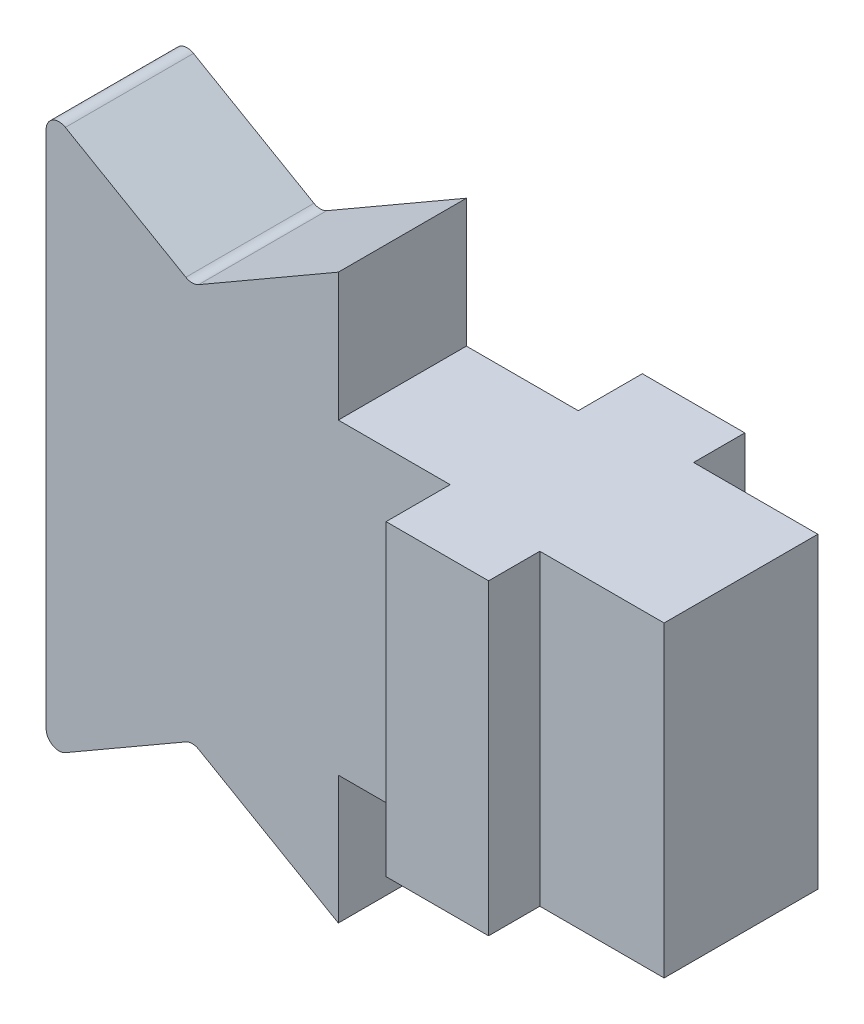
ISO-10303-21;
HEADER;
FILE_DESCRIPTION(('STEP AP214'),'2;1');
FILE_NAME('part.step','',(''),(''),'','','');
FILE_SCHEMA(('AUTOMOTIVE_DESIGN { 1 0 10303 214 1 1 1 1 }'));
ENDSEC;
DATA;
#1=APPLICATION_CONTEXT('core data for automotive mechanical design processes');
#2=APPLICATION_PROTOCOL_DEFINITION('international standard','automotive_design',2000,#1);
#3=PRODUCT_CONTEXT('',#1,'mechanical');
#4=PRODUCT('Part','Part','',(#3));
#5=PRODUCT_RELATED_PRODUCT_CATEGORY('part','',(#4));
#6=PRODUCT_DEFINITION_FORMATION('','',#4);
#7=PRODUCT_DEFINITION_CONTEXT('part definition',#1,'design');
#8=PRODUCT_DEFINITION('design','',#6,#7);
#9=PRODUCT_DEFINITION_SHAPE('','',#8);
#10=(LENGTH_UNIT() NAMED_UNIT(*) SI_UNIT(.MILLI.,.METRE.));
#11=(NAMED_UNIT(*) PLANE_ANGLE_UNIT() SI_UNIT($,.RADIAN.));
#12=(NAMED_UNIT(*) SI_UNIT($,.STERADIAN.) SOLID_ANGLE_UNIT());
#13=UNCERTAINTY_MEASURE_WITH_UNIT(LENGTH_MEASURE(1.E-05),#10,'distance_accuracy_value','');
#14=(GEOMETRIC_REPRESENTATION_CONTEXT(3) GLOBAL_UNCERTAINTY_ASSIGNED_CONTEXT((#13)) GLOBAL_UNIT_ASSIGNED_CONTEXT((#10,
#11,#12)) REPRESENTATION_CONTEXT('',''));
#15=CARTESIAN_POINT('',(0.,0.,0.));
#16=DIRECTION('',(0.,0.,1.));
#17=DIRECTION('',(1.,0.,0.));
#18=AXIS2_PLACEMENT_3D('',#15,#16,#17);
#19=CARTESIAN_POINT('',(-28.1320066515452,-16.5717489288077,5.));
#20=DIRECTION('',(0.,0.,-1.));
#21=DIRECTION('',(-1.,0.,0.));
#22=AXIS2_PLACEMENT_3D('',#19,#20,#21);
#23=CYLINDRICAL_SURFACE('',#22,1.);
#24=DIRECTION('',(0.,0.,1.));
#25=VECTOR('',#24,1.);
#26=CARTESIAN_POINT('',(-28.6320066515452,-15.7057235250233,5.));
#27=LINE('',#26,#25);
#28=CARTESIAN_POINT('',(-28.6320066515452,-15.7057235250233,5.));
#29=VERTEX_POINT('',#28);
#30=CARTESIAN_POINT('',(-28.6320066515452,-15.7057235250233,-5.));
#31=VERTEX_POINT('',#30);
#32=EDGE_CURVE('E255',#29,#31,#27,.F.);
#33=ORIENTED_EDGE('',*,*,#32,.T.);
#34=CARTESIAN_POINT('',(-28.1320066515452,-16.5717489288077,-5.));
#35=DIRECTION('',(0.,0.,-1.));
#36=DIRECTION('',(-1.,0.,0.));
#37=AXIS2_PLACEMENT_3D('',#34,#35,#36);
#38=CIRCLE('',#37,1.);
#39=CARTESIAN_POINT('',(-27.6320066515452,-15.7057235250233,-5.));
#40=VERTEX_POINT('',#39);
#41=EDGE_CURVE('E201',#31,#40,#38,.T.);
#42=ORIENTED_EDGE('',*,*,#41,.T.);
#43=DIRECTION('',(0.,0.,1.));
#44=VECTOR('',#43,1.);
#45=CARTESIAN_POINT('',(-27.6320066515452,-15.7057235250233,5.));
#46=LINE('',#45,#44);
#47=CARTESIAN_POINT('',(-27.6320066515452,-15.7057235250233,5.));
#48=VERTEX_POINT('',#47);
#49=EDGE_CURVE('E213',#40,#48,#46,.T.);
#50=ORIENTED_EDGE('',*,*,#49,.T.);
#51=CARTESIAN_POINT('',(-28.1320066515452,-16.5717489288077,5.));
#52=DIRECTION('',(0.,0.,-1.));
#53=DIRECTION('',(-1.,0.,0.));
#54=AXIS2_PLACEMENT_3D('',#51,#52,#53);
#55=CIRCLE('',#54,1.);
#56=EDGE_CURVE('E20',#29,#48,#55,.T.);
#57=ORIENTED_EDGE('',*,*,#56,.F.);
#58=EDGE_LOOP('',(#33,#42,#50,#57));
#59=FACE_BOUND('',#58,.T.);
#60=ADVANCED_FACE('F17',(#59),#23,.F.);
#61=CARTESIAN_POINT('',(-8.,12.,10.));
#62=DIRECTION('',(1.,0.,0.));
#63=DIRECTION('',(0.,1.,0.));
#64=AXIS2_PLACEMENT_3D('',#61,#62,#63);
#65=PLANE('',#64);
#66=DIRECTION('',(0.,1.,0.));
#67=VECTOR('',#66,1.);
#68=CARTESIAN_POINT('',(-8.,-2.,-5.));
#69=LINE('',#68,#67);
#70=CARTESIAN_POINT('',(-8.,-12.,-5.));
#71=VERTEX_POINT('',#70);
#72=CARTESIAN_POINT('',(-8.,12.,-5.));
#73=VERTEX_POINT('',#72);
#74=EDGE_CURVE('E165',#71,#73,#69,.T.);
#75=ORIENTED_EDGE('',*,*,#74,.T.);
#76=DIRECTION('',(0.,0.,1.));
#77=VECTOR('',#76,1.);
#78=CARTESIAN_POINT('',(-8.,12.,5.));
#79=LINE('',#78,#77);
#80=CARTESIAN_POINT('',(-8.,12.,-10.));
#81=VERTEX_POINT('',#80);
#82=EDGE_CURVE('E159',#73,#81,#79,.F.);
#83=ORIENTED_EDGE('',*,*,#82,.T.);
#84=DIRECTION('',(0.,1.,0.));
#85=VECTOR('',#84,1.);
#86=CARTESIAN_POINT('',(-8.,-12.,-10.));
#87=LINE('',#86,#85);
#88=CARTESIAN_POINT('',(-8.,-12.,-10.));
#89=VERTEX_POINT('',#88);
#90=EDGE_CURVE('E162',#81,#89,#87,.F.);
#91=ORIENTED_EDGE('',*,*,#90,.T.);
#92=DIRECTION('',(0.,0.,1.));
#93=VECTOR('',#92,1.);
#94=CARTESIAN_POINT('',(-8.,-12.,5.));
#95=LINE('',#94,#93);
#96=EDGE_CURVE('E219',#89,#71,#95,.T.);
#97=ORIENTED_EDGE('',*,*,#96,.T.);
#98=EDGE_LOOP('',(#75,#83,#91,#97));
#99=FACE_BOUND('',#98,.T.);
#100=ADVANCED_FACE('F161',(#99),#65,.F.);
#101=CARTESIAN_POINT('',(-8.,-12.,-10.));
#102=DIRECTION('',(0.,0.,1.));
#103=DIRECTION('',(1.,0.,0.));
#104=AXIS2_PLACEMENT_3D('',#101,#102,#103);
#105=PLANE('',#104);
#106=DIRECTION('',(1.,0.,0.));
#107=VECTOR('',#106,1.);
#108=CARTESIAN_POINT('',(-16.5,12.,-10.));
#109=LINE('',#108,#107);
#110=CARTESIAN_POINT('',(0.,12.,-10.));
#111=VERTEX_POINT('',#110);
#112=EDGE_CURVE('E170',#81,#111,#109,.T.);
#113=ORIENTED_EDGE('',*,*,#112,.T.);
#114=DIRECTION('',(0.,-1.,0.));
#115=VECTOR('',#114,1.);
#116=CARTESIAN_POINT('',(0.,12.,-10.));
#117=LINE('',#116,#115);
#118=CARTESIAN_POINT('',(0.,-12.,-10.));
#119=VERTEX_POINT('',#118);
#120=EDGE_CURVE('E179',#111,#119,#117,.T.);
#121=ORIENTED_EDGE('',*,*,#120,.T.);
#122=DIRECTION('',(-1.,0.,0.));
#123=VECTOR('',#122,1.);
#124=CARTESIAN_POINT('',(0.,-12.,-10.));
#125=LINE('',#124,#123);
#126=EDGE_CURVE('E177',#119,#89,#125,.T.);
#127=ORIENTED_EDGE('',*,*,#126,.T.);
#128=ORIENTED_EDGE('',*,*,#90,.F.);
#129=EDGE_LOOP('',(#113,#121,#127,#128));
#130=FACE_BOUND('',#129,.T.);
#131=ADVANCED_FACE('F174',(#130),#105,.F.);
#132=CARTESIAN_POINT('',(0.,12.,5.));
#133=DIRECTION('',(-1.,0.,0.));
#134=DIRECTION('',(0.,-1.,0.));
#135=AXIS2_PLACEMENT_3D('',#132,#133,#134);
#136=PLANE('',#135);
#137=DIRECTION('',(0.,0.,1.));
#138=VECTOR('',#137,1.);
#139=CARTESIAN_POINT('',(0.,-12.,5.));
#140=LINE('',#139,#138);
#141=CARTESIAN_POINT('',(0.,-12.,-6.));
#142=VERTEX_POINT('',#141);
#143=EDGE_CURVE('E226',#142,#119,#140,.F.);
#144=ORIENTED_EDGE('',*,*,#143,.T.);
#145=ORIENTED_EDGE('',*,*,#120,.F.);
#146=DIRECTION('',(0.,0.,1.));
#147=VECTOR('',#146,1.);
#148=CARTESIAN_POINT('',(0.,12.,5.));
#149=LINE('',#148,#147);
#150=CARTESIAN_POINT('',(0.,12.,-6.));
#151=VERTEX_POINT('',#150);
#152=EDGE_CURVE('E185',#111,#151,#149,.T.);
#153=ORIENTED_EDGE('',*,*,#152,.T.);
#154=DIRECTION('',(0.,1.,0.));
#155=VECTOR('',#154,1.);
#156=CARTESIAN_POINT('',(0.,-27.4301652615907,-6.));
#157=LINE('',#156,#155);
#158=EDGE_CURVE('E318',#142,#151,#157,.T.);
#159=ORIENTED_EDGE('',*,*,#158,.F.);
#160=EDGE_LOOP('',(#144,#145,#153,#159));
#161=FACE_BOUND('',#160,.T.);
#162=ADVANCED_FACE('F331',(#161),#136,.F.);
#163=CARTESIAN_POINT('',(0.,-27.4301652615907,-6.));
#164=DIRECTION('',(0.,0.,-1.));
#165=DIRECTION('',(-1.,0.,0.));
#166=AXIS2_PLACEMENT_3D('',#163,#164,#165);
#167=PLANE('',#166);
#168=DIRECTION('',(1.,0.,0.));
#169=VECTOR('',#168,1.);
#170=CARTESIAN_POINT('',(-16.5,12.,-6.));
#171=LINE('',#170,#169);
#172=CARTESIAN_POINT('',(9.7,12.,-6.));
#173=VERTEX_POINT('',#172);
#174=EDGE_CURVE('E187',#151,#173,#171,.T.);
#175=ORIENTED_EDGE('',*,*,#174,.T.);
#176=DIRECTION('',(0.,1.,0.));
#177=VECTOR('',#176,1.);
#178=CARTESIAN_POINT('',(9.7,-27.4301652615907,-6.));
#179=LINE('',#178,#177);
#180=CARTESIAN_POINT('',(9.7,-12.,-6.));
#181=VERTEX_POINT('',#180);
#182=EDGE_CURVE('E310',#181,#173,#179,.T.);
#183=ORIENTED_EDGE('',*,*,#182,.F.);
#184=DIRECTION('',(-1.,0.,0.));
#185=VECTOR('',#184,1.);
#186=CARTESIAN_POINT('',(0.,-12.,-6.));
#187=LINE('',#186,#185);
#188=EDGE_CURVE('E231',#181,#142,#187,.T.);
#189=ORIENTED_EDGE('',*,*,#188,.T.);
#190=ORIENTED_EDGE('',*,*,#158,.T.);
#191=EDGE_LOOP('',(#175,#183,#189,#190));
#192=FACE_BOUND('',#191,.T.);
#193=ADVANCED_FACE('F629',(#192),#167,.T.);
#194=CARTESIAN_POINT('',(9.7,-27.4301652615907,6.));
#195=DIRECTION('',(1.,0.,0.));
#196=DIRECTION('',(0.,0.,-1.));
#197=AXIS2_PLACEMENT_3D('',#194,#195,#196);
#198=PLANE('',#197);
#199=DIRECTION('',(0.,0.,1.));
#200=VECTOR('',#199,1.);
#201=CARTESIAN_POINT('',(9.7,12.,5.));
#202=LINE('',#201,#200);
#203=CARTESIAN_POINT('',(9.7,12.,6.));
#204=VERTEX_POINT('',#203);
#205=EDGE_CURVE('E305',#173,#204,#202,.T.);
#206=ORIENTED_EDGE('',*,*,#205,.T.);
#207=DIRECTION('',(0.,1.,0.));
#208=VECTOR('',#207,1.);
#209=CARTESIAN_POINT('',(9.7,-27.4301652615907,6.));
#210=LINE('',#209,#208);
#211=CARTESIAN_POINT('',(9.7,-12.,6.));
#212=VERTEX_POINT('',#211);
#213=EDGE_CURVE('E288',#212,#204,#210,.T.);
#214=ORIENTED_EDGE('',*,*,#213,.F.);
#215=DIRECTION('',(0.,0.,1.));
#216=VECTOR('',#215,1.);
#217=CARTESIAN_POINT('',(9.7,-12.,5.));
#218=LINE('',#217,#216);
#219=EDGE_CURVE('E236',#212,#181,#218,.F.);
#220=ORIENTED_EDGE('',*,*,#219,.T.);
#221=ORIENTED_EDGE('',*,*,#182,.T.);
#222=EDGE_LOOP('',(#206,#214,#220,#221));
#223=FACE_BOUND('',#222,.T.);
#224=ADVANCED_FACE('F619',(#223),#198,.T.);
#225=CARTESIAN_POINT('',(0.,-27.4301652615907,6.));
#226=DIRECTION('',(0.,0.,1.));
#227=DIRECTION('',(1.,0.,0.));
#228=AXIS2_PLACEMENT_3D('',#225,#226,#227);
#229=PLANE('',#228);
#230=DIRECTION('',(1.,0.,0.));
#231=VECTOR('',#230,1.);
#232=CARTESIAN_POINT('',(-16.5,12.,6.));
#233=LINE('',#232,#231);
#234=CARTESIAN_POINT('',(0.,12.,6.));
#235=VERTEX_POINT('',#234);
#236=EDGE_CURVE('E299',#204,#235,#233,.F.);
#237=ORIENTED_EDGE('',*,*,#236,.T.);
#238=DIRECTION('',(0.,-1.,0.));
#239=VECTOR('',#238,1.);
#240=CARTESIAN_POINT('',(0.,12.,6.));
#241=LINE('',#240,#239);
#242=CARTESIAN_POINT('',(0.,-12.,6.));
#243=VERTEX_POINT('',#242);
#244=EDGE_CURVE('E283',#235,#243,#241,.T.);
#245=ORIENTED_EDGE('',*,*,#244,.T.);
#246=DIRECTION('',(-1.,0.,0.));
#247=VECTOR('',#246,1.);
#248=CARTESIAN_POINT('',(0.,-12.,6.));
#249=LINE('',#248,#247);
#250=EDGE_CURVE('E241',#243,#212,#249,.F.);
#251=ORIENTED_EDGE('',*,*,#250,.T.);
#252=ORIENTED_EDGE('',*,*,#213,.T.);
#253=EDGE_LOOP('',(#237,#245,#251,#252));
#254=FACE_BOUND('',#253,.T.);
#255=ADVANCED_FACE('F609',(#254),#229,.T.);
#256=CARTESIAN_POINT('',(0.,12.,5.));
#257=DIRECTION('',(-1.,0.,0.));
#258=DIRECTION('',(0.,-1.,0.));
#259=AXIS2_PLACEMENT_3D('',#256,#257,#258);
#260=PLANE('',#259);
#261=ORIENTED_EDGE('',*,*,#244,.F.);
#262=DIRECTION('',(0.,0.,1.));
#263=VECTOR('',#262,1.);
#264=CARTESIAN_POINT('',(0.,12.,5.));
#265=LINE('',#264,#263);
#266=CARTESIAN_POINT('',(0.,12.,10.));
#267=VERTEX_POINT('',#266);
#268=EDGE_CURVE('E296',#235,#267,#265,.T.);
#269=ORIENTED_EDGE('',*,*,#268,.T.);
#270=DIRECTION('',(0.,1.,0.));
#271=VECTOR('',#270,1.);
#272=CARTESIAN_POINT('',(0.,-12.,10.));
#273=LINE('',#272,#271);
#274=CARTESIAN_POINT('',(0.,-12.,10.));
#275=VERTEX_POINT('',#274);
#276=EDGE_CURVE('E278',#275,#267,#273,.T.);
#277=ORIENTED_EDGE('',*,*,#276,.F.);
#278=DIRECTION('',(0.,0.,1.));
#279=VECTOR('',#278,1.);
#280=CARTESIAN_POINT('',(0.,-12.,5.));
#281=LINE('',#280,#279);
#282=EDGE_CURVE('E207',#275,#243,#281,.F.);
#283=ORIENTED_EDGE('',*,*,#282,.T.);
#284=EDGE_LOOP('',(#261,#269,#277,#283));
#285=FACE_BOUND('',#284,.T.);
#286=ADVANCED_FACE('F600',(#285),#260,.F.);
#287=CARTESIAN_POINT('',(-8.,-12.,10.));
#288=DIRECTION('',(0.,0.,1.));
#289=DIRECTION('',(1.,0.,0.));
#290=AXIS2_PLACEMENT_3D('',#287,#288,#289);
#291=PLANE('',#290);
#292=ORIENTED_EDGE('',*,*,#276,.T.);
#293=DIRECTION('',(1.,0.,0.));
#294=VECTOR('',#293,1.);
#295=CARTESIAN_POINT('',(-16.5,12.,10.));
#296=LINE('',#295,#294);
#297=CARTESIAN_POINT('',(-8.,12.,10.));
#298=VERTEX_POINT('',#297);
#299=EDGE_CURVE('E298',#267,#298,#296,.F.);
#300=ORIENTED_EDGE('',*,*,#299,.T.);
#301=DIRECTION('',(0.,1.,0.));
#302=VECTOR('',#301,1.);
#303=CARTESIAN_POINT('',(-8.,12.,10.));
#304=LINE('',#303,#302);
#305=CARTESIAN_POINT('',(-8.,-12.,10.));
#306=VERTEX_POINT('',#305);
#307=EDGE_CURVE('E349',#298,#306,#304,.F.);
#308=ORIENTED_EDGE('',*,*,#307,.T.);
#309=DIRECTION('',(-1.,0.,0.));
#310=VECTOR('',#309,1.);
#311=CARTESIAN_POINT('',(0.,-12.,10.));
#312=LINE('',#311,#310);
#313=EDGE_CURVE('E204',#306,#275,#312,.F.);
#314=ORIENTED_EDGE('',*,*,#313,.T.);
#315=EDGE_LOOP('',(#292,#300,#308,#314));
#316=FACE_BOUND('',#315,.T.);
#317=ADVANCED_FACE('F590',(#316),#291,.T.);
#318=CARTESIAN_POINT('',(-28.1320066515452,16.5717491821275,5.));
#319=DIRECTION('',(0.,0.,-1.));
#320=DIRECTION('',(-1.,0.,0.));
#321=AXIS2_PLACEMENT_3D('',#318,#319,#320);
#322=CYLINDRICAL_SURFACE('',#321,1.);
#323=DIRECTION('',(0.,0.,1.));
#324=VECTOR('',#323,1.);
#325=CARTESIAN_POINT('',(-27.6320066515452,15.7057237783431,5.));
#326=LINE('',#325,#324);
#327=CARTESIAN_POINT('',(-27.6320066515452,15.7057237783431,5.));
#328=VERTEX_POINT('',#327);
#329=CARTESIAN_POINT('',(-27.6320066515452,15.705723778343,-5.));
#330=VERTEX_POINT('',#329);
#331=EDGE_CURVE('E409',#328,#330,#326,.F.);
#332=ORIENTED_EDGE('',*,*,#331,.T.);
#333=CARTESIAN_POINT('',(-28.1320066515452,16.5717491821275,-5.));
#334=DIRECTION('',(0.,0.,-1.));
#335=DIRECTION('',(-1.,0.,0.));
#336=AXIS2_PLACEMENT_3D('',#333,#334,#335);
#337=CIRCLE('',#336,1.);
#338=CARTESIAN_POINT('',(-28.6320066515452,15.7057237783431,-5.));
#339=VERTEX_POINT('',#338);
#340=EDGE_CURVE('E200',#330,#339,#337,.T.);
#341=ORIENTED_EDGE('',*,*,#340,.T.);
#342=DIRECTION('',(0.,0.,1.));
#343=VECTOR('',#342,1.);
#344=CARTESIAN_POINT('',(-28.6320066515452,15.7057237783431,5.));
#345=LINE('',#344,#343);
#346=CARTESIAN_POINT('',(-28.6320066515452,15.7057237783431,5.));
#347=VERTEX_POINT('',#346);
#348=EDGE_CURVE('E408',#339,#347,#345,.T.);
#349=ORIENTED_EDGE('',*,*,#348,.T.);
#350=CARTESIAN_POINT('',(-28.1320066515452,16.5717491821275,5.));
#351=DIRECTION('',(0.,0.,-1.));
#352=DIRECTION('',(-1.,0.,0.));
#353=AXIS2_PLACEMENT_3D('',#350,#351,#352);
#354=CIRCLE('',#353,1.);
#355=EDGE_CURVE('E277',#328,#347,#354,.T.);
#356=ORIENTED_EDGE('',*,*,#355,.F.);
#357=EDGE_LOOP('',(#332,#341,#349,#356));
#358=FACE_BOUND('',#357,.T.);
#359=ADVANCED_FACE('F581',(#358),#322,.F.);
#360=CARTESIAN_POINT('',(-16.5,-2.,-5.));
#361=DIRECTION('',(0.,0.,1.));
#362=DIRECTION('',(1.,0.,0.));
#363=AXIS2_PLACEMENT_3D('',#360,#361,#362);
#364=PLANE('',#363);
#365=DIRECTION('',(0.,1.,0.));
#366=VECTOR('',#365,1.);
#367=CARTESIAN_POINT('',(-39.5340133030904,17.0000002533198,-5.));
#368=LINE('',#367,#366);
#369=CARTESIAN_POINT('',(-39.5340133030904,20.2679494457509,-5.));
#370=VERTEX_POINT('',#369);
#371=CARTESIAN_POINT('',(-39.5340133030904,-20.2679491924311,-5.));
#372=VERTEX_POINT('',#371);
#373=EDGE_CURVE('E269',#370,#372,#368,.F.);
#374=ORIENTED_EDGE('',*,*,#373,.F.);
#375=CARTESIAN_POINT('',(-38.5340133030904,20.2679494457509,-5.));
#376=DIRECTION('',(0.,0.,1.));
#377=DIRECTION('',(1.,0.,0.));
#378=AXIS2_PLACEMENT_3D('',#375,#376,#377);
#379=CIRCLE('',#378,1.);
#380=CARTESIAN_POINT('',(-38.0340133030904,21.1339748495354,-5.));
#381=VERTEX_POINT('',#380);
#382=EDGE_CURVE('E270',#381,#370,#379,.T.);
#383=ORIENTED_EDGE('',*,*,#382,.F.);
#384=DIRECTION('',(0.866025403784439,-0.5,0.));
#385=VECTOR('',#384,1.);
#386=CARTESIAN_POINT('',(-28.1320066515452,15.4170486437483,-5.));
#387=LINE('',#386,#385);
#388=EDGE_CURVE('E405',#381,#339,#387,.T.);
#389=ORIENTED_EDGE('',*,*,#388,.T.);
#390=ORIENTED_EDGE('',*,*,#340,.F.);
#391=DIRECTION('',(0.86602540378444,0.499999999999997,0.));
#392=VECTOR('',#391,1.);
#393=CARTESIAN_POINT('',(-16.73,22.0000002533197,-5.));
#394=LINE('',#393,#392);
#395=CARTESIAN_POINT('',(-16.73,22.0000002533197,-5.));
#396=VERTEX_POINT('',#395);
#397=EDGE_CURVE('E410',#330,#396,#394,.T.);
#398=ORIENTED_EDGE('',*,*,#397,.T.);
#399=DIRECTION('',(0.,1.,0.));
#400=VECTOR('',#399,1.);
#401=CARTESIAN_POINT('',(-16.73,12.,-5.));
#402=LINE('',#401,#400);
#403=CARTESIAN_POINT('',(-16.73,12.,-5.));
#404=VERTEX_POINT('',#403);
#405=EDGE_CURVE('E343',#404,#396,#402,.T.);
#406=ORIENTED_EDGE('',*,*,#405,.F.);
#407=DIRECTION('',(1.,0.,0.));
#408=VECTOR('',#407,1.);
#409=CARTESIAN_POINT('',(-16.5,12.,-5.));
#410=LINE('',#409,#408);
#411=EDGE_CURVE('E171',#404,#73,#410,.T.);
#412=ORIENTED_EDGE('',*,*,#411,.T.);
#413=ORIENTED_EDGE('',*,*,#74,.F.);
#414=DIRECTION('',(-1.,0.,0.));
#415=VECTOR('',#414,1.);
#416=CARTESIAN_POINT('',(0.,-12.,-5.));
#417=LINE('',#416,#415);
#418=CARTESIAN_POINT('',(-16.73,-12.,-5.));
#419=VERTEX_POINT('',#418);
#420=EDGE_CURVE('E216',#71,#419,#417,.T.);
#421=ORIENTED_EDGE('',*,*,#420,.T.);
#422=DIRECTION('',(0.,1.,0.));
#423=VECTOR('',#422,1.);
#424=CARTESIAN_POINT('',(-16.73,-17.,-5.));
#425=LINE('',#424,#423);
#426=CARTESIAN_POINT('',(-16.73,-22.,-5.));
#427=VERTEX_POINT('',#426);
#428=EDGE_CURVE('E210',#427,#419,#425,.T.);
#429=ORIENTED_EDGE('',*,*,#428,.F.);
#430=DIRECTION('',(-0.866025403784438,0.500000000000001,0.));
#431=VECTOR('',#430,1.);
#432=CARTESIAN_POINT('',(-28.1320066515452,-15.4170483904285,-5.));
#433=LINE('',#432,#431);
#434=EDGE_CURVE('E252',#427,#40,#433,.T.);
#435=ORIENTED_EDGE('',*,*,#434,.T.);
#436=ORIENTED_EDGE('',*,*,#41,.F.);
#437=DIRECTION('',(-0.866025403784439,-0.5,0.));
#438=VECTOR('',#437,1.);
#439=CARTESIAN_POINT('',(-39.5340133030904,-22.,-5.));
#440=LINE('',#439,#438);
#441=CARTESIAN_POINT('',(-38.0340133030904,-21.1339745962156,-5.));
#442=VERTEX_POINT('',#441);
#443=EDGE_CURVE('E258',#31,#442,#440,.T.);
#444=ORIENTED_EDGE('',*,*,#443,.T.);
#445=CARTESIAN_POINT('',(-38.5340133030904,-20.2679491924311,-5.));
#446=DIRECTION('',(0.,0.,-1.));
#447=DIRECTION('',(-1.,0.,0.));
#448=AXIS2_PLACEMENT_3D('',#445,#446,#447);
#449=CIRCLE('',#448,1.);
#450=EDGE_CURVE('E261',#372,#442,#449,.F.);
#451=ORIENTED_EDGE('',*,*,#450,.F.);
#452=EDGE_LOOP('',(#374,#383,#389,#390,#398,#406,#412,#413,#421,#429,#435,#436,#444,#451));
#453=FACE_BOUND('',#452,.T.);
#454=ADVANCED_FACE('F339',(#453),#364,.F.);
#455=CARTESIAN_POINT('',(-38.5340133030904,-20.2679491924311,0.));
#456=DIRECTION('',(0.,0.,-1.));
#457=DIRECTION('',(-1.,0.,0.));
#458=AXIS2_PLACEMENT_3D('',#455,#456,#457);
#459=CYLINDRICAL_SURFACE('',#458,1.);
#460=CARTESIAN_POINT('',(-38.5340133030904,-20.2679491924311,5.));
#461=DIRECTION('',(0.,0.,-1.));
#462=DIRECTION('',(-1.,0.,0.));
#463=AXIS2_PLACEMENT_3D('',#460,#461,#462);
#464=CIRCLE('',#463,1.);
#465=CARTESIAN_POINT('',(-39.5340133030904,-20.2679491924311,5.));
#466=VERTEX_POINT('',#465);
#467=CARTESIAN_POINT('',(-38.0340133030904,-21.1339745962156,5.));
#468=VERTEX_POINT('',#467);
#469=EDGE_CURVE('E265',#466,#468,#464,.F.);
#470=ORIENTED_EDGE('',*,*,#469,.F.);
#471=DIRECTION('',(0.,0.,1.));
#472=VECTOR('',#471,1.);
#473=CARTESIAN_POINT('',(-39.5340133030904,-20.2679491924311,-5.));
#474=LINE('',#473,#472);
#475=EDGE_CURVE('E272',#372,#466,#474,.T.);
#476=ORIENTED_EDGE('',*,*,#475,.F.);
#477=ORIENTED_EDGE('',*,*,#450,.T.);
#478=DIRECTION('',(0.,0.,1.));
#479=VECTOR('',#478,1.);
#480=CARTESIAN_POINT('',(-38.0340133030904,-21.1339745962156,5.));
#481=LINE('',#480,#479);
#482=EDGE_CURVE('E260',#442,#468,#481,.T.);
#483=ORIENTED_EDGE('',*,*,#482,.T.);
#484=EDGE_LOOP('',(#470,#476,#477,#483));
#485=FACE_BOUND('',#484,.T.);
#486=ADVANCED_FACE('F562',(#485),#459,.T.);
#487=CARTESIAN_POINT('',(-39.5340133030904,-22.,5.));
#488=DIRECTION('',(-0.5,0.866025403784439,0.));
#489=DIRECTION('',(-0.866025403784439,-0.5,0.));
#490=AXIS2_PLACEMENT_3D('',#487,#488,#489);
#491=PLANE('',#490);
#492=DIRECTION('',(0.866025403784437,0.500000000000002,0.));
#493=VECTOR('',#492,1.);
#494=CARTESIAN_POINT('',(-38.0340133030904,-21.1339745962156,5.));
#495=LINE('',#494,#493);
#496=EDGE_CURVE('E268',#468,#29,#495,.T.);
#497=ORIENTED_EDGE('',*,*,#496,.F.);
#498=ORIENTED_EDGE('',*,*,#482,.F.);
#499=ORIENTED_EDGE('',*,*,#443,.F.);
#500=ORIENTED_EDGE('',*,*,#32,.F.);
#501=EDGE_LOOP('',(#497,#498,#499,#500));
#502=FACE_BOUND('',#501,.T.);
#503=ADVANCED_FACE('F553',(#502),#491,.F.);
#504=CARTESIAN_POINT('',(-28.1320066515452,-15.4170483904285,5.));
#505=DIRECTION('',(0.500000000000001,0.866025403784438,0.));
#506=DIRECTION('',(-0.866025403784438,0.500000000000001,0.));
#507=AXIS2_PLACEMENT_3D('',#504,#505,#506);
#508=PLANE('',#507);
#509=ORIENTED_EDGE('',*,*,#434,.F.);
#510=DIRECTION('',(0.,0.,-1.));
#511=VECTOR('',#510,1.);
#512=CARTESIAN_POINT('',(-16.73,-22.,-5.));
#513=LINE('',#512,#511);
#514=CARTESIAN_POINT('',(-16.73,-22.,5.));
#515=VERTEX_POINT('',#514);
#516=EDGE_CURVE('E97',#515,#427,#513,.T.);
#517=ORIENTED_EDGE('',*,*,#516,.F.);
#518=DIRECTION('',(0.866025403784439,-0.499999999999999,0.));
#519=VECTOR('',#518,1.);
#520=CARTESIAN_POINT('',(-27.6320066515452,-15.7057235250233,5.));
#521=LINE('',#520,#519);
#522=EDGE_CURVE('E394',#48,#515,#521,.T.);
#523=ORIENTED_EDGE('',*,*,#522,.F.);
#524=ORIENTED_EDGE('',*,*,#49,.F.);
#525=EDGE_LOOP('',(#509,#517,#523,#524));
#526=FACE_BOUND('',#525,.T.);
#527=ADVANCED_FACE('F543',(#526),#508,.F.);
#528=CARTESIAN_POINT('',(-16.73,-17.,-5.));
#529=DIRECTION('',(1.,0.,0.));
#530=DIRECTION('',(0.,0.,-1.));
#531=AXIS2_PLACEMENT_3D('',#528,#529,#530);
#532=PLANE('',#531);
#533=DIRECTION('',(0.,1.,0.));
#534=VECTOR('',#533,1.);
#535=CARTESIAN_POINT('',(-16.73,-2.,5.));
#536=LINE('',#535,#534);
#537=CARTESIAN_POINT('',(-16.73,-12.,5.));
#538=VERTEX_POINT('',#537);
#539=EDGE_CURVE('E386',#515,#538,#536,.T.);
#540=ORIENTED_EDGE('',*,*,#539,.F.);
#541=ORIENTED_EDGE('',*,*,#516,.T.);
#542=ORIENTED_EDGE('',*,*,#428,.T.);
#543=DIRECTION('',(0.,0.,1.));
#544=VECTOR('',#543,1.);
#545=CARTESIAN_POINT('',(-16.73,-12.,5.));
#546=LINE('',#545,#544);
#547=EDGE_CURVE('E218',#419,#538,#546,.T.);
#548=ORIENTED_EDGE('',*,*,#547,.T.);
#549=EDGE_LOOP('',(#540,#541,#542,#548));
#550=FACE_BOUND('',#549,.T.);
#551=ADVANCED_FACE('F534',(#550),#532,.T.);
#552=CARTESIAN_POINT('',(0.,-12.,5.));
#553=DIRECTION('',(0.,1.,0.));
#554=DIRECTION('',(-1.,0.,0.));
#555=AXIS2_PLACEMENT_3D('',#552,#553,#554);
#556=PLANE('',#555);
#557=ORIENTED_EDGE('',*,*,#420,.F.);
#558=ORIENTED_EDGE('',*,*,#96,.F.);
#559=ORIENTED_EDGE('',*,*,#126,.F.);
#560=ORIENTED_EDGE('',*,*,#143,.F.);
#561=ORIENTED_EDGE('',*,*,#188,.F.);
#562=ORIENTED_EDGE('',*,*,#219,.F.);
#563=ORIENTED_EDGE('',*,*,#250,.F.);
#564=ORIENTED_EDGE('',*,*,#282,.F.);
#565=ORIENTED_EDGE('',*,*,#313,.F.);
#566=DIRECTION('',(0.,0.,1.));
#567=VECTOR('',#566,1.);
#568=CARTESIAN_POINT('',(-8.,-12.,10.));
#569=LINE('',#568,#567);
#570=CARTESIAN_POINT('',(-8.,-12.,5.));
#571=VERTEX_POINT('',#570);
#572=EDGE_CURVE('E346',#306,#571,#569,.F.);
#573=ORIENTED_EDGE('',*,*,#572,.T.);
#574=DIRECTION('',(1.,0.,0.));
#575=VECTOR('',#574,1.);
#576=CARTESIAN_POINT('',(-16.5,-12.,5.));
#577=LINE('',#576,#575);
#578=EDGE_CURVE('E379',#538,#571,#577,.T.);
#579=ORIENTED_EDGE('',*,*,#578,.F.);
#580=ORIENTED_EDGE('',*,*,#547,.F.);
#581=EDGE_LOOP('',(#557,#558,#559,#560,#561,#562,#563,#564,#565,#573,#579,#580));
#582=FACE_BOUND('',#581,.T.);
#583=ADVANCED_FACE('F335',(#582),#556,.F.);
#584=CARTESIAN_POINT('',(-8.,12.,10.));
#585=DIRECTION('',(1.,0.,0.));
#586=DIRECTION('',(0.,1.,0.));
#587=AXIS2_PLACEMENT_3D('',#584,#585,#586);
#588=PLANE('',#587);
#589=ORIENTED_EDGE('',*,*,#572,.F.);
#590=ORIENTED_EDGE('',*,*,#307,.F.);
#591=DIRECTION('',(0.,0.,1.));
#592=VECTOR('',#591,1.);
#593=CARTESIAN_POINT('',(-8.,12.,5.));
#594=LINE('',#593,#592);
#595=CARTESIAN_POINT('',(-8.,12.,5.));
#596=VERTEX_POINT('',#595);
#597=EDGE_CURVE('E360',#298,#596,#594,.F.);
#598=ORIENTED_EDGE('',*,*,#597,.T.);
#599=DIRECTION('',(0.,1.,0.));
#600=VECTOR('',#599,1.);
#601=CARTESIAN_POINT('',(-8.,-2.,5.));
#602=LINE('',#601,#600);
#603=EDGE_CURVE('E375',#571,#596,#602,.T.);
#604=ORIENTED_EDGE('',*,*,#603,.F.);
#605=EDGE_LOOP('',(#589,#590,#598,#604));
#606=FACE_BOUND('',#605,.T.);
#607=ADVANCED_FACE('F517',(#606),#588,.F.);
#608=CARTESIAN_POINT('',(-16.5,12.,5.));
#609=DIRECTION('',(0.,-1.,0.));
#610=DIRECTION('',(1.,0.,0.));
#611=AXIS2_PLACEMENT_3D('',#608,#609,#610);
#612=PLANE('',#611);
#613=DIRECTION('',(1.,0.,0.));
#614=VECTOR('',#613,1.);
#615=CARTESIAN_POINT('',(-16.5,12.,5.));
#616=LINE('',#615,#614);
#617=CARTESIAN_POINT('',(-16.73,12.,5.));
#618=VERTEX_POINT('',#617);
#619=EDGE_CURVE('E378',#596,#618,#616,.F.);
#620=ORIENTED_EDGE('',*,*,#619,.F.);
#621=ORIENTED_EDGE('',*,*,#597,.F.);
#622=ORIENTED_EDGE('',*,*,#299,.F.);
#623=ORIENTED_EDGE('',*,*,#268,.F.);
#624=ORIENTED_EDGE('',*,*,#236,.F.);
#625=ORIENTED_EDGE('',*,*,#205,.F.);
#626=ORIENTED_EDGE('',*,*,#174,.F.);
#627=ORIENTED_EDGE('',*,*,#152,.F.);
#628=ORIENTED_EDGE('',*,*,#112,.F.);
#629=ORIENTED_EDGE('',*,*,#82,.F.);
#630=ORIENTED_EDGE('',*,*,#411,.F.);
#631=DIRECTION('',(0.,0.,-1.));
#632=VECTOR('',#631,1.);
#633=CARTESIAN_POINT('',(-16.73,12.,-5.));
#634=LINE('',#633,#632);
#635=EDGE_CURVE('E368',#618,#404,#634,.T.);
#636=ORIENTED_EDGE('',*,*,#635,.F.);
#637=EDGE_LOOP('',(#620,#621,#622,#623,#624,#625,#626,#627,#628,#629,#630,#636));
#638=FACE_BOUND('',#637,.T.);
#639=ADVANCED_FACE('F183',(#638),#612,.F.);
#640=CARTESIAN_POINT('',(-16.73,12.,-5.));
#641=DIRECTION('',(1.,0.,0.));
#642=DIRECTION('',(0.,0.,-1.));
#643=AXIS2_PLACEMENT_3D('',#640,#641,#642);
#644=PLANE('',#643);
#645=DIRECTION('',(0.,1.,0.));
#646=VECTOR('',#645,1.);
#647=CARTESIAN_POINT('',(-16.73,-2.,5.));
#648=LINE('',#647,#646);
#649=CARTESIAN_POINT('',(-16.73,22.0000002533197,5.));
#650=VERTEX_POINT('',#649);
#651=EDGE_CURVE('E426',#618,#650,#648,.T.);
#652=ORIENTED_EDGE('',*,*,#651,.F.);
#653=ORIENTED_EDGE('',*,*,#635,.T.);
#654=ORIENTED_EDGE('',*,*,#405,.T.);
#655=DIRECTION('',(0.,0.,1.));
#656=VECTOR('',#655,1.);
#657=CARTESIAN_POINT('',(-16.73,22.0000002533197,5.));
#658=LINE('',#657,#656);
#659=EDGE_CURVE('E412',#396,#650,#658,.T.);
#660=ORIENTED_EDGE('',*,*,#659,.T.);
#661=EDGE_LOOP('',(#652,#653,#654,#660));
#662=FACE_BOUND('',#661,.T.);
#663=ADVANCED_FACE('F499',(#662),#644,.T.);
#664=CARTESIAN_POINT('',(-16.73,22.0000002533197,5.));
#665=DIRECTION('',(0.499999999999997,-0.86602540378444,0.));
#666=DIRECTION('',(0.86602540378444,0.499999999999997,0.));
#667=AXIS2_PLACEMENT_3D('',#664,#665,#666);
#668=PLANE('',#667);
#669=DIRECTION('',(-0.866025403784442,-0.499999999999993,0.));
#670=VECTOR('',#669,1.);
#671=CARTESIAN_POINT('',(-16.73,22.0000002533197,5.));
#672=LINE('',#671,#670);
#673=EDGE_CURVE('E429',#650,#328,#672,.T.);
#674=ORIENTED_EDGE('',*,*,#673,.F.);
#675=ORIENTED_EDGE('',*,*,#659,.F.);
#676=ORIENTED_EDGE('',*,*,#397,.F.);
#677=ORIENTED_EDGE('',*,*,#331,.F.);
#678=EDGE_LOOP('',(#674,#675,#676,#677));
#679=FACE_BOUND('',#678,.T.);
#680=ADVANCED_FACE('F465',(#679),#668,.F.);
#681=CARTESIAN_POINT('',(-28.1320066515452,15.4170486437483,5.));
#682=DIRECTION('',(-0.5,-0.866025403784439,0.));
#683=DIRECTION('',(0.866025403784439,-0.5,0.));
#684=AXIS2_PLACEMENT_3D('',#681,#682,#683);
#685=PLANE('',#684);
#686=ORIENTED_EDGE('',*,*,#388,.F.);
#687=DIRECTION('',(0.,0.,1.));
#688=VECTOR('',#687,1.);
#689=CARTESIAN_POINT('',(-38.0340133030904,21.1339748495354,0.));
#690=LINE('',#689,#688);
#691=CARTESIAN_POINT('',(-38.0340133030904,21.1339748495354,5.));
#692=VERTEX_POINT('',#691);
#693=EDGE_CURVE('E273',#692,#381,#690,.F.);
#694=ORIENTED_EDGE('',*,*,#693,.F.);
#695=DIRECTION('',(-0.866025403784437,0.500000000000002,0.));
#696=VECTOR('',#695,1.);
#697=CARTESIAN_POINT('',(-28.6320066515452,15.7057237783431,5.));
#698=LINE('',#697,#696);
#699=EDGE_CURVE('E264',#347,#692,#698,.T.);
#700=ORIENTED_EDGE('',*,*,#699,.F.);
#701=ORIENTED_EDGE('',*,*,#348,.F.);
#702=EDGE_LOOP('',(#686,#694,#700,#701));
#703=FACE_BOUND('',#702,.T.);
#704=ADVANCED_FACE('F452',(#703),#685,.F.);
#705=CARTESIAN_POINT('',(-38.5340133030904,20.2679494457509,0.));
#706=DIRECTION('',(0.,0.,1.));
#707=DIRECTION('',(1.,0.,0.));
#708=AXIS2_PLACEMENT_3D('',#705,#706,#707);
#709=CYLINDRICAL_SURFACE('',#708,1.);
#710=ORIENTED_EDGE('',*,*,#382,.T.);
#711=DIRECTION('',(0.,0.,1.));
#712=VECTOR('',#711,1.);
#713=CARTESIAN_POINT('',(-39.5340133030904,20.2679494457509,-5.));
#714=LINE('',#713,#712);
#715=CARTESIAN_POINT('',(-39.5340133030904,20.2679494457509,5.));
#716=VERTEX_POINT('',#715);
#717=EDGE_CURVE('E35',#716,#370,#714,.F.);
#718=ORIENTED_EDGE('',*,*,#717,.F.);
#719=CARTESIAN_POINT('',(-38.5340133030904,20.2679494457509,5.));
#720=DIRECTION('',(0.,0.,1.));
#721=DIRECTION('',(1.,0.,0.));
#722=AXIS2_PLACEMENT_3D('',#719,#720,#721);
#723=CIRCLE('',#722,1.);
#724=EDGE_CURVE('E26',#692,#716,#723,.T.);
#725=ORIENTED_EDGE('',*,*,#724,.F.);
#726=ORIENTED_EDGE('',*,*,#693,.T.);
#727=EDGE_LOOP('',(#710,#718,#725,#726));
#728=FACE_BOUND('',#727,.T.);
#729=ADVANCED_FACE('F454',(#728),#709,.T.);
#730=CARTESIAN_POINT('',(-39.5340133030904,17.0000002533198,-5.));
#731=DIRECTION('',(-1.,0.,0.));
#732=DIRECTION('',(0.,0.,1.));
#733=AXIS2_PLACEMENT_3D('',#730,#731,#732);
#734=PLANE('',#733);
#735=ORIENTED_EDGE('',*,*,#717,.T.);
#736=ORIENTED_EDGE('',*,*,#373,.T.);
#737=ORIENTED_EDGE('',*,*,#475,.T.);
#738=DIRECTION('',(0.,1.,0.));
#739=VECTOR('',#738,1.);
#740=CARTESIAN_POINT('',(-39.5340133030904,-2.,5.));
#741=LINE('',#740,#739);
#742=EDGE_CURVE('E11',#716,#466,#741,.F.);
#743=ORIENTED_EDGE('',*,*,#742,.F.);
#744=EDGE_LOOP('',(#735,#736,#737,#743));
#745=FACE_BOUND('',#744,.T.);
#746=ADVANCED_FACE('F456',(#745),#734,.T.);
#747=CARTESIAN_POINT('',(-16.5,-2.,5.));
#748=DIRECTION('',(0.,0.,1.));
#749=DIRECTION('',(1.,0.,0.));
#750=AXIS2_PLACEMENT_3D('',#747,#748,#749);
#751=PLANE('',#750);
#752=ORIENTED_EDGE('',*,*,#724,.T.);
#753=ORIENTED_EDGE('',*,*,#742,.T.);
#754=ORIENTED_EDGE('',*,*,#469,.T.);
#755=ORIENTED_EDGE('',*,*,#496,.T.);
#756=ORIENTED_EDGE('',*,*,#56,.T.);
#757=ORIENTED_EDGE('',*,*,#522,.T.);
#758=ORIENTED_EDGE('',*,*,#539,.T.);
#759=ORIENTED_EDGE('',*,*,#578,.T.);
#760=ORIENTED_EDGE('',*,*,#603,.T.);
#761=ORIENTED_EDGE('',*,*,#619,.T.);
#762=ORIENTED_EDGE('',*,*,#651,.T.);
#763=ORIENTED_EDGE('',*,*,#673,.T.);
#764=ORIENTED_EDGE('',*,*,#355,.T.);
#765=ORIENTED_EDGE('',*,*,#699,.T.);
#766=EDGE_LOOP('',(#752,#753,#754,#755,#756,#757,#758,#759,#760,#761,#762,#763,#764,#765));
#767=FACE_BOUND('',#766,.T.);
#768=ADVANCED_FACE('F449',(#767),#751,.T.);
#769=CLOSED_SHELL('',(#60,#100,#131,#162,#193,#224,#255,#286,#317,#359,#454,#486,#503,#527,#551,
#583,#607,#639,#663,#680,#704,#729,#746,#768));
#770=MANIFOLD_SOLID_BREP('B1',#769);
#771=ADVANCED_BREP_SHAPE_REPRESENTATION('',(#18,#770),#14);
#772=SHAPE_DEFINITION_REPRESENTATION(#9,#771);
ENDSEC;
END-ISO-10303-21;
